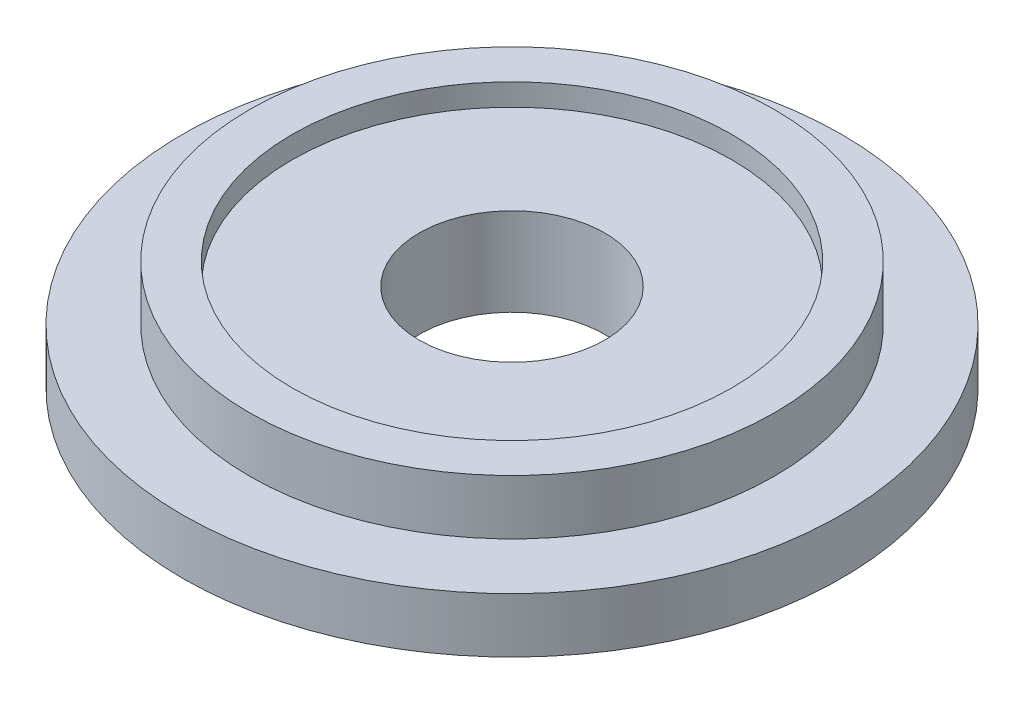
ISO-10303-21;
HEADER;
FILE_DESCRIPTION(('STEP AP214'),'2;1');
FILE_NAME('part.step','',(''),(''),'','','');
FILE_SCHEMA(('AUTOMOTIVE_DESIGN { 1 0 10303 214 1 1 1 1 }'));
ENDSEC;
DATA;
#1=APPLICATION_CONTEXT('core data for automotive mechanical design processes');
#2=APPLICATION_PROTOCOL_DEFINITION('international standard','automotive_design',2000,#1);
#3=PRODUCT_CONTEXT('',#1,'mechanical');
#4=PRODUCT('Part','Part','',(#3));
#5=PRODUCT_RELATED_PRODUCT_CATEGORY('part','',(#4));
#6=PRODUCT_DEFINITION_FORMATION('','',#4);
#7=PRODUCT_DEFINITION_CONTEXT('part definition',#1,'design');
#8=PRODUCT_DEFINITION('design','',#6,#7);
#9=PRODUCT_DEFINITION_SHAPE('','',#8);
#10=(LENGTH_UNIT() NAMED_UNIT(*) SI_UNIT(.MILLI.,.METRE.));
#11=(NAMED_UNIT(*) PLANE_ANGLE_UNIT() SI_UNIT($,.RADIAN.));
#12=(NAMED_UNIT(*) SI_UNIT($,.STERADIAN.) SOLID_ANGLE_UNIT());
#13=UNCERTAINTY_MEASURE_WITH_UNIT(LENGTH_MEASURE(1.E-05),#10,'distance_accuracy_value','');
#14=(GEOMETRIC_REPRESENTATION_CONTEXT(3) GLOBAL_UNCERTAINTY_ASSIGNED_CONTEXT((#13)) GLOBAL_UNIT_ASSIGNED_CONTEXT((#10,
#11,#12)) REPRESENTATION_CONTEXT('',''));
#15=CARTESIAN_POINT('',(0.,0.,0.));
#16=DIRECTION('',(0.,0.,1.));
#17=DIRECTION('',(1.,0.,0.));
#18=AXIS2_PLACEMENT_3D('',#15,#16,#17);
#19=CARTESIAN_POINT('',(0.,5.,0.));
#20=DIRECTION('',(0.,-1.,0.));
#21=DIRECTION('',(0.,0.,-1.));
#22=AXIS2_PLACEMENT_3D('',#19,#20,#21);
#23=CYLINDRICAL_SURFACE('',#22,8.45);
#24=CARTESIAN_POINT('',(0.,-5.,0.));
#25=DIRECTION('',(0.,1.,0.));
#26=DIRECTION('',(0.,0.,1.));
#27=AXIS2_PLACEMENT_3D('',#24,#25,#26);
#28=CIRCLE('',#27,8.45);
#29=CARTESIAN_POINT('',(0.,-5.,8.45));
#30=VERTEX_POINT('',#29);
#31=EDGE_CURVE('E53',#30,#30,#28,.T.);
#32=ORIENTED_EDGE('',*,*,#31,.F.);
#33=EDGE_LOOP('',(#32));
#34=FACE_BOUND('',#33,.T.);
#35=CARTESIAN_POINT('',(0.,3.,0.));
#36=DIRECTION('',(0.,1.,0.));
#37=DIRECTION('',(0.,0.,1.));
#38=AXIS2_PLACEMENT_3D('',#35,#36,#37);
#39=CIRCLE('',#38,8.45);
#40=CARTESIAN_POINT('',(0.,3.,8.45));
#41=VERTEX_POINT('',#40);
#42=EDGE_CURVE('E44',#41,#41,#39,.T.);
#43=ORIENTED_EDGE('',*,*,#42,.T.);
#44=EDGE_LOOP('',(#43));
#45=FACE_BOUND('',#44,.T.);
#46=ADVANCED_FACE('F41',(#34,#45),#23,.F.);
#47=CARTESIAN_POINT('',(0.,5.,0.));
#48=DIRECTION('',(0.,-1.,0.));
#49=DIRECTION('',(0.,0.,-1.));
#50=AXIS2_PLACEMENT_3D('',#47,#48,#49);
#51=CYLINDRICAL_SURFACE('',#50,23.9);
#52=CARTESIAN_POINT('',(0.,5.,0.));
#53=DIRECTION('',(0.,1.,0.));
#54=DIRECTION('',(0.,0.,1.));
#55=AXIS2_PLACEMENT_3D('',#52,#53,#54);
#56=CIRCLE('',#55,23.9);
#57=CARTESIAN_POINT('',(0.,5.,23.9));
#58=VERTEX_POINT('',#57);
#59=EDGE_CURVE('E10',#58,#58,#56,.T.);
#60=ORIENTED_EDGE('',*,*,#59,.F.);
#61=EDGE_LOOP('',(#60));
#62=FACE_BOUND('',#61,.T.);
#63=CARTESIAN_POINT('',(0.,0.,0.));
#64=DIRECTION('',(0.,1.,0.));
#65=DIRECTION('',(0.,0.,1.));
#66=AXIS2_PLACEMENT_3D('',#63,#64,#65);
#67=CIRCLE('',#66,23.9);
#68=CARTESIAN_POINT('',(0.,0.,23.9));
#69=VERTEX_POINT('',#68);
#70=EDGE_CURVE('E48',#69,#69,#67,.T.);
#71=ORIENTED_EDGE('',*,*,#70,.T.);
#72=EDGE_LOOP('',(#71));
#73=FACE_BOUND('',#72,.T.);
#74=ADVANCED_FACE('F85',(#62,#73),#51,.T.);
#75=CARTESIAN_POINT('',(0.,5.,0.));
#76=DIRECTION('',(0.,1.,0.));
#77=DIRECTION('',(0.,0.,1.));
#78=AXIS2_PLACEMENT_3D('',#75,#76,#77);
#79=PLANE('',#78);
#80=CARTESIAN_POINT('',(0.,5.,0.));
#81=DIRECTION('',(0.,1.,0.));
#82=DIRECTION('',(0.,0.,1.));
#83=AXIS2_PLACEMENT_3D('',#80,#81,#82);
#84=CIRCLE('',#83,20.);
#85=CARTESIAN_POINT('',(0.,5.,20.));
#86=VERTEX_POINT('',#85);
#87=EDGE_CURVE('E63',#86,#86,#84,.T.);
#88=ORIENTED_EDGE('',*,*,#87,.F.);
#89=EDGE_LOOP('',(#88));
#90=FACE_BOUND('',#89,.T.);
#91=ORIENTED_EDGE('',*,*,#59,.T.);
#92=EDGE_LOOP('',(#91));
#93=FACE_BOUND('',#92,.T.);
#94=ADVANCED_FACE('F92',(#90,#93),#79,.T.);
#95=CARTESIAN_POINT('',(0.,-5.,0.));
#96=DIRECTION('',(0.,1.,0.));
#97=DIRECTION('',(0.,0.,1.));
#98=AXIS2_PLACEMENT_3D('',#95,#96,#97);
#99=CYLINDRICAL_SURFACE('',#98,30.);
#100=CARTESIAN_POINT('',(0.,-5.,0.));
#101=DIRECTION('',(0.,1.,0.));
#102=DIRECTION('',(0.,0.,1.));
#103=AXIS2_PLACEMENT_3D('',#100,#101,#102);
#104=CIRCLE('',#103,30.);
#105=CARTESIAN_POINT('',(0.,-5.,30.));
#106=VERTEX_POINT('',#105);
#107=EDGE_CURVE('E58',#106,#106,#104,.T.);
#108=ORIENTED_EDGE('',*,*,#107,.T.);
#109=EDGE_LOOP('',(#108));
#110=FACE_BOUND('',#109,.T.);
#111=CARTESIAN_POINT('',(0.,0.,0.));
#112=DIRECTION('',(0.,1.,0.));
#113=DIRECTION('',(0.,0.,1.));
#114=AXIS2_PLACEMENT_3D('',#111,#112,#113);
#115=CIRCLE('',#114,30.);
#116=CARTESIAN_POINT('',(0.,0.,30.));
#117=VERTEX_POINT('',#116);
#118=EDGE_CURVE('E55',#117,#117,#115,.T.);
#119=ORIENTED_EDGE('',*,*,#118,.F.);
#120=EDGE_LOOP('',(#119));
#121=FACE_BOUND('',#120,.T.);
#122=ADVANCED_FACE('F98',(#110,#121),#99,.T.);
#123=CARTESIAN_POINT('',(0.,-5.,0.));
#124=DIRECTION('',(0.,1.,0.));
#125=DIRECTION('',(0.,0.,1.));
#126=AXIS2_PLACEMENT_3D('',#123,#124,#125);
#127=PLANE('',#126);
#128=ORIENTED_EDGE('',*,*,#107,.F.);
#129=EDGE_LOOP('',(#128));
#130=FACE_BOUND('',#129,.T.);
#131=ORIENTED_EDGE('',*,*,#31,.T.);
#132=EDGE_LOOP('',(#131));
#133=FACE_BOUND('',#132,.T.);
#134=ADVANCED_FACE('F96',(#130,#133),#127,.F.);
#135=CARTESIAN_POINT('',(0.,0.,0.));
#136=DIRECTION('',(0.,1.,0.));
#137=DIRECTION('',(0.,0.,1.));
#138=AXIS2_PLACEMENT_3D('',#135,#136,#137);
#139=PLANE('',#138);
#140=ORIENTED_EDGE('',*,*,#70,.F.);
#141=EDGE_LOOP('',(#140));
#142=FACE_BOUND('',#141,.T.);
#143=ORIENTED_EDGE('',*,*,#118,.T.);
#144=EDGE_LOOP('',(#143));
#145=FACE_BOUND('',#144,.T.);
#146=ADVANCED_FACE('F81',(#142,#145),#139,.T.);
#147=CARTESIAN_POINT('',(0.,3.,0.));
#148=DIRECTION('',(0.,1.,0.));
#149=DIRECTION('',(0.,0.,1.));
#150=AXIS2_PLACEMENT_3D('',#147,#148,#149);
#151=CYLINDRICAL_SURFACE('',#150,20.);
#152=CARTESIAN_POINT('',(0.,3.,0.));
#153=DIRECTION('',(0.,1.,0.));
#154=DIRECTION('',(0.,0.,1.));
#155=AXIS2_PLACEMENT_3D('',#152,#153,#154);
#156=CIRCLE('',#155,20.);
#157=CARTESIAN_POINT('',(0.,3.,20.));
#158=VERTEX_POINT('',#157);
#159=EDGE_CURVE('E66',#158,#158,#156,.T.);
#160=ORIENTED_EDGE('',*,*,#159,.F.);
#161=EDGE_LOOP('',(#160));
#162=FACE_BOUND('',#161,.T.);
#163=ORIENTED_EDGE('',*,*,#87,.T.);
#164=EDGE_LOOP('',(#163));
#165=FACE_BOUND('',#164,.T.);
#166=ADVANCED_FACE('F76',(#162,#165),#151,.F.);
#167=CARTESIAN_POINT('',(0.,3.,0.));
#168=DIRECTION('',(0.,1.,0.));
#169=DIRECTION('',(0.,0.,1.));
#170=AXIS2_PLACEMENT_3D('',#167,#168,#169);
#171=PLANE('',#170);
#172=ORIENTED_EDGE('',*,*,#42,.F.);
#173=EDGE_LOOP('',(#172));
#174=FACE_BOUND('',#173,.T.);
#175=ORIENTED_EDGE('',*,*,#159,.T.);
#176=EDGE_LOOP('',(#175));
#177=FACE_BOUND('',#176,.T.);
#178=ADVANCED_FACE('F74',(#174,#177),#171,.T.);
#179=CLOSED_SHELL('',(#46,#74,#94,#122,#134,#146,#166,#178));
#180=MANIFOLD_SOLID_BREP('B2',#179);
#181=ADVANCED_BREP_SHAPE_REPRESENTATION('',(#18,#180),#14);
#182=SHAPE_DEFINITION_REPRESENTATION(#9,#181);
ENDSEC;
END-ISO-10303-21;
